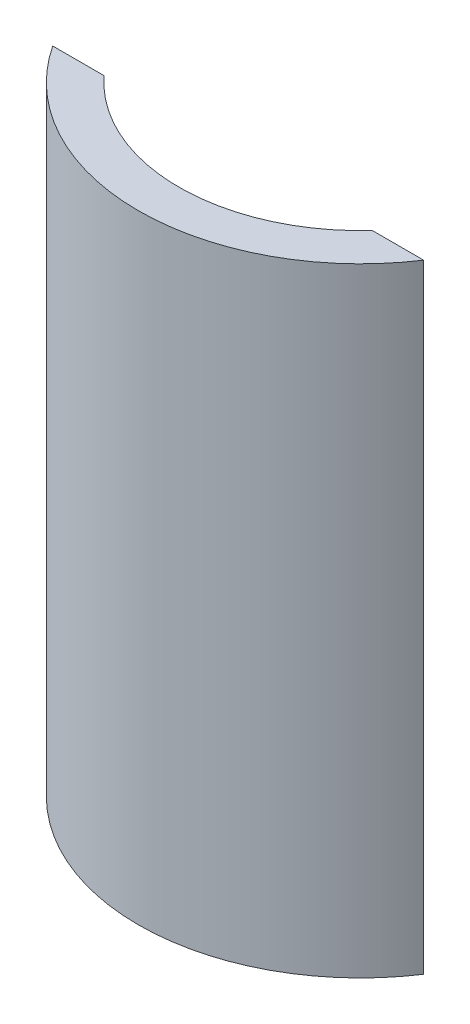
ISO-10303-21;
HEADER;
FILE_DESCRIPTION(('STEP AP214'),'2;1');
FILE_NAME('part.step','',(''),(''),'','','');
FILE_SCHEMA(('AUTOMOTIVE_DESIGN { 1 0 10303 214 1 1 1 1 }'));
ENDSEC;
DATA;
#1=APPLICATION_CONTEXT('core data for automotive mechanical design processes');
#2=APPLICATION_PROTOCOL_DEFINITION('international standard','automotive_design',2000,#1);
#3=PRODUCT_CONTEXT('',#1,'mechanical');
#4=PRODUCT('Part','Part','',(#3));
#5=PRODUCT_RELATED_PRODUCT_CATEGORY('part','',(#4));
#6=PRODUCT_DEFINITION_FORMATION('','',#4);
#7=PRODUCT_DEFINITION_CONTEXT('part definition',#1,'design');
#8=PRODUCT_DEFINITION('design','',#6,#7);
#9=PRODUCT_DEFINITION_SHAPE('','',#8);
#10=(LENGTH_UNIT() NAMED_UNIT(*) SI_UNIT(.MILLI.,.METRE.));
#11=(NAMED_UNIT(*) PLANE_ANGLE_UNIT() SI_UNIT($,.RADIAN.));
#12=(NAMED_UNIT(*) SI_UNIT($,.STERADIAN.) SOLID_ANGLE_UNIT());
#13=UNCERTAINTY_MEASURE_WITH_UNIT(LENGTH_MEASURE(1.E-05),#10,'distance_accuracy_value','');
#14=(GEOMETRIC_REPRESENTATION_CONTEXT(3) GLOBAL_UNCERTAINTY_ASSIGNED_CONTEXT((#13)) GLOBAL_UNIT_ASSIGNED_CONTEXT((#10,
#11,#12)) REPRESENTATION_CONTEXT('',''));
#15=CARTESIAN_POINT('',(0.,0.,0.));
#16=DIRECTION('',(0.,0.,1.));
#17=DIRECTION('',(1.,0.,0.));
#18=AXIS2_PLACEMENT_3D('',#15,#16,#17);
#19=CARTESIAN_POINT('',(0.,0.,27.6960130524233));
#20=DIRECTION('',(0.,0.,1.));
#21=DIRECTION('',(1.,0.,0.));
#22=AXIS2_PLACEMENT_3D('',#19,#20,#21);
#23=PLANE('',#22);
#24=DIRECTION('',(-1.,0.,0.));
#25=VECTOR('',#24,1.);
#26=CARTESIAN_POINT('',(-42.3504748256234,9.025,27.6960130524233));
#27=LINE('',#26,#25);
#28=CARTESIAN_POINT('',(-30.3487580211707,9.025,27.6960130524233));
#29=VERTEX_POINT('',#28);
#30=CARTESIAN_POINT('',(-41.9787580211706,9.02500000000001,27.6960130524233));
#31=VERTEX_POINT('',#30);
#32=EDGE_CURVE('E309',#29,#31,#27,.T.);
#33=ORIENTED_EDGE('',*,*,#32,.F.);
#34=DIRECTION('',(0.,-1.,0.));
#35=VECTOR('',#34,1.);
#36=CARTESIAN_POINT('',(-30.3487580211706,100.,27.6960130524233));
#37=LINE('',#36,#35);
#38=CARTESIAN_POINT('',(-30.3487580211706,0.,27.6960130524233));
#39=VERTEX_POINT('',#38);
#40=EDGE_CURVE('E217',#29,#39,#37,.T.);
#41=ORIENTED_EDGE('',*,*,#40,.T.);
#42=DIRECTION('',(1.,0.,0.));
#43=VECTOR('',#42,1.);
#44=CARTESIAN_POINT('',(0.,0.,27.6960130524233));
#45=LINE('',#44,#43);
#46=CARTESIAN_POINT('',(-41.9787580211706,0.,27.6960130524233));
#47=VERTEX_POINT('',#46);
#48=EDGE_CURVE('E43',#47,#39,#45,.T.);
#49=ORIENTED_EDGE('',*,*,#48,.F.);
#50=DIRECTION('',(0.,-1.,0.));
#51=VECTOR('',#50,1.);
#52=CARTESIAN_POINT('',(-41.9787580211706,100.,27.6960130524233));
#53=LINE('',#52,#51);
#54=EDGE_CURVE('E257',#31,#47,#53,.T.);
#55=ORIENTED_EDGE('',*,*,#54,.F.);
#56=EDGE_LOOP('',(#33,#41,#49,#55));
#57=FACE_BOUND('',#56,.T.);
#58=ADVANCED_FACE('F40',(#57),#23,.F.);
#59=CARTESIAN_POINT('',(30.3487580211706,0.,27.6960130524233));
#60=VERTEX_POINT('',#59);
#61=CARTESIAN_POINT('',(41.9787580211706,0.,27.6960130524233));
#62=VERTEX_POINT('',#61);
#63=EDGE_CURVE('E273',#60,#62,#45,.T.);
#64=ORIENTED_EDGE('',*,*,#63,.F.);
#65=DIRECTION('',(0.,-1.,0.));
#66=VECTOR('',#65,1.);
#67=CARTESIAN_POINT('',(30.3487580211706,100.,27.6960130524233));
#68=LINE('',#67,#66);
#69=CARTESIAN_POINT('',(30.3487580211707,9.02500000000001,27.6960130524232));
#70=VERTEX_POINT('',#69);
#71=EDGE_CURVE('E290',#70,#60,#68,.T.);
#72=ORIENTED_EDGE('',*,*,#71,.F.);
#73=DIRECTION('',(-1.,0.,0.));
#74=VECTOR('',#73,1.);
#75=CARTESIAN_POINT('',(42.3504748256234,9.025,27.6960130524232));
#76=LINE('',#75,#74);
#77=CARTESIAN_POINT('',(41.9787580211707,9.02500000000001,27.6960130524232));
#78=VERTEX_POINT('',#77);
#79=EDGE_CURVE('E312',#78,#70,#76,.T.);
#80=ORIENTED_EDGE('',*,*,#79,.F.);
#81=DIRECTION('',(0.,-1.,0.));
#82=VECTOR('',#81,1.);
#83=CARTESIAN_POINT('',(41.9787580211706,100.,27.6960130524233));
#84=LINE('',#83,#82);
#85=EDGE_CURVE('E254',#62,#78,#84,.F.);
#86=ORIENTED_EDGE('',*,*,#85,.F.);
#87=EDGE_LOOP('',(#64,#72,#80,#86));
#88=FACE_BOUND('',#87,.T.);
#89=ADVANCED_FACE('F339',(#88),#23,.F.);
#90=DIRECTION('',(-1.,0.,0.));
#91=VECTOR('',#90,1.);
#92=CARTESIAN_POINT('',(-42.3504748256234,29.025,27.6960130524233));
#93=LINE('',#92,#91);
#94=CARTESIAN_POINT('',(-30.3487580211707,29.025,27.6960130524233));
#95=VERTEX_POINT('',#94);
#96=CARTESIAN_POINT('',(-41.9787580211706,29.025,27.6960130524233));
#97=VERTEX_POINT('',#96);
#98=EDGE_CURVE('E221',#95,#97,#93,.T.);
#99=ORIENTED_EDGE('',*,*,#98,.F.);
#100=CARTESIAN_POINT('',(-30.3487580211707,10.975,27.6960130524233));
#101=VERTEX_POINT('',#100);
#102=EDGE_CURVE('E207',#95,#101,#37,.T.);
#103=ORIENTED_EDGE('',*,*,#102,.T.);
#104=DIRECTION('',(-1.,0.,0.));
#105=VECTOR('',#104,1.);
#106=CARTESIAN_POINT('',(-42.3504748256234,10.975,27.6960130524233));
#107=LINE('',#106,#105);
#108=CARTESIAN_POINT('',(-41.9787580211706,10.975,27.6960130524233));
#109=VERTEX_POINT('',#108);
#110=EDGE_CURVE('E301',#101,#109,#107,.T.);
#111=ORIENTED_EDGE('',*,*,#110,.T.);
#112=EDGE_CURVE('E223',#97,#109,#53,.T.);
#113=ORIENTED_EDGE('',*,*,#112,.F.);
#114=EDGE_LOOP('',(#99,#103,#111,#113));
#115=FACE_BOUND('',#114,.T.);
#116=ADVANCED_FACE('F222',(#115),#23,.F.);
#117=CARTESIAN_POINT('',(-30.3487580211707,49.025,27.6960130524233));
#118=VERTEX_POINT('',#117);
#119=CARTESIAN_POINT('',(-30.3487580211707,30.975,27.6960130524233));
#120=VERTEX_POINT('',#119);
#121=EDGE_CURVE('E218',#118,#120,#37,.T.);
#122=ORIENTED_EDGE('',*,*,#121,.T.);
#123=DIRECTION('',(-1.,0.,0.));
#124=VECTOR('',#123,1.);
#125=CARTESIAN_POINT('',(-42.3504748256234,30.975,27.6960130524233));
#126=LINE('',#125,#124);
#127=CARTESIAN_POINT('',(-41.9787580211706,30.975,27.6960130524233));
#128=VERTEX_POINT('',#127);
#129=EDGE_CURVE('E56',#120,#128,#126,.T.);
#130=ORIENTED_EDGE('',*,*,#129,.T.);
#131=CARTESIAN_POINT('',(-41.9787580211706,49.025,27.6960130524233));
#132=VERTEX_POINT('',#131);
#133=EDGE_CURVE('E264',#132,#128,#53,.T.);
#134=ORIENTED_EDGE('',*,*,#133,.F.);
#135=DIRECTION('',(-1.,0.,0.));
#136=VECTOR('',#135,1.);
#137=CARTESIAN_POINT('',(-42.3504748256234,49.025,27.6960130524233));
#138=LINE('',#137,#136);
#139=EDGE_CURVE('E394',#118,#132,#138,.T.);
#140=ORIENTED_EDGE('',*,*,#139,.F.);
#141=EDGE_LOOP('',(#122,#130,#134,#140));
#142=FACE_BOUND('',#141,.T.);
#143=ADVANCED_FACE('F347',(#142),#23,.F.);
#144=DIRECTION('',(-1.,0.,0.));
#145=VECTOR('',#144,1.);
#146=CARTESIAN_POINT('',(-42.3504748256234,69.025,27.6960130524233));
#147=LINE('',#146,#145);
#148=CARTESIAN_POINT('',(-30.3487580211707,69.025,27.6960130524233));
#149=VERTEX_POINT('',#148);
#150=CARTESIAN_POINT('',(-41.9787580211706,69.025,27.6960130524233));
#151=VERTEX_POINT('',#150);
#152=EDGE_CURVE('E427',#149,#151,#147,.T.);
#153=ORIENTED_EDGE('',*,*,#152,.F.);
#154=CARTESIAN_POINT('',(-30.3487580211707,50.975,27.6960130524233));
#155=VERTEX_POINT('',#154);
#156=EDGE_CURVE('E244',#149,#155,#37,.T.);
#157=ORIENTED_EDGE('',*,*,#156,.T.);
#158=DIRECTION('',(-1.,0.,0.));
#159=VECTOR('',#158,1.);
#160=CARTESIAN_POINT('',(-42.3504748256234,50.975,27.6960130524233));
#161=LINE('',#160,#159);
#162=CARTESIAN_POINT('',(-41.9787580211706,50.975,27.6960130524233));
#163=VERTEX_POINT('',#162);
#164=EDGE_CURVE('E64',#155,#163,#161,.T.);
#165=ORIENTED_EDGE('',*,*,#164,.T.);
#166=EDGE_CURVE('E261',#151,#163,#53,.T.);
#167=ORIENTED_EDGE('',*,*,#166,.F.);
#168=EDGE_LOOP('',(#153,#157,#165,#167));
#169=FACE_BOUND('',#168,.T.);
#170=ADVANCED_FACE('F447',(#169),#23,.F.);
#171=DIRECTION('',(1.,0.,0.));
#172=VECTOR('',#171,1.);
#173=CARTESIAN_POINT('',(0.,140.,27.6960130524233));
#174=LINE('',#173,#172);
#175=CARTESIAN_POINT('',(-41.9787580211706,140.,27.6960130524233));
#176=VERTEX_POINT('',#175);
#177=CARTESIAN_POINT('',(-30.3487580211707,140.,27.6960130524233));
#178=VERTEX_POINT('',#177);
#179=EDGE_CURVE('E246',#176,#178,#174,.T.);
#180=ORIENTED_EDGE('',*,*,#179,.T.);
#181=CARTESIAN_POINT('',(-30.3487580211707,90.975,27.6960130524233));
#182=VERTEX_POINT('',#181);
#183=EDGE_CURVE('E231',#178,#182,#37,.T.);
#184=ORIENTED_EDGE('',*,*,#183,.T.);
#185=DIRECTION('',(-1.,0.,0.));
#186=VECTOR('',#185,1.);
#187=CARTESIAN_POINT('',(-42.3504748256234,90.975,27.6960130524233));
#188=LINE('',#187,#186);
#189=CARTESIAN_POINT('',(-41.9787580211706,90.975,27.6960130524233));
#190=VERTEX_POINT('',#189);
#191=EDGE_CURVE('E48',#182,#190,#188,.T.);
#192=ORIENTED_EDGE('',*,*,#191,.T.);
#193=EDGE_CURVE('E252',#176,#190,#53,.T.);
#194=ORIENTED_EDGE('',*,*,#193,.F.);
#195=EDGE_LOOP('',(#180,#184,#192,#194));
#196=FACE_BOUND('',#195,.T.);
#197=ADVANCED_FACE('F348',(#196),#23,.F.);
#198=DIRECTION('',(-1.,0.,0.));
#199=VECTOR('',#198,1.);
#200=CARTESIAN_POINT('',(-42.3504748256234,70.975,27.6960130524233));
#201=LINE('',#200,#199);
#202=CARTESIAN_POINT('',(-30.3487580211707,70.975,27.6960130524233));
#203=VERTEX_POINT('',#202);
#204=CARTESIAN_POINT('',(-41.9787580211706,70.975,27.6960130524233));
#205=VERTEX_POINT('',#204);
#206=EDGE_CURVE('E366',#203,#205,#201,.T.);
#207=ORIENTED_EDGE('',*,*,#206,.T.);
#208=CARTESIAN_POINT('',(-41.9787580211706,89.025,27.6960130524233));
#209=VERTEX_POINT('',#208);
#210=EDGE_CURVE('E256',#209,#205,#53,.T.);
#211=ORIENTED_EDGE('',*,*,#210,.F.);
#212=DIRECTION('',(-1.,0.,0.));
#213=VECTOR('',#212,1.);
#214=CARTESIAN_POINT('',(-42.3504748256234,89.025,27.6960130524233));
#215=LINE('',#214,#213);
#216=CARTESIAN_POINT('',(-30.3487580211707,89.025,27.6960130524233));
#217=VERTEX_POINT('',#216);
#218=EDGE_CURVE('E433',#217,#209,#215,.T.);
#219=ORIENTED_EDGE('',*,*,#218,.F.);
#220=EDGE_CURVE('E238',#217,#203,#37,.T.);
#221=ORIENTED_EDGE('',*,*,#220,.T.);
#222=EDGE_LOOP('',(#207,#211,#219,#221));
#223=FACE_BOUND('',#222,.T.);
#224=ADVANCED_FACE('F337',(#223),#23,.F.);
#225=DIRECTION('',(-1.,0.,0.));
#226=VECTOR('',#225,1.);
#227=CARTESIAN_POINT('',(42.3504748256234,10.975,27.6960130524232));
#228=LINE('',#227,#226);
#229=CARTESIAN_POINT('',(41.9787580211707,10.975,27.6960130524232));
#230=VERTEX_POINT('',#229);
#231=CARTESIAN_POINT('',(30.3487580211707,10.975,27.6960130524232));
#232=VERTEX_POINT('',#231);
#233=EDGE_CURVE('E304',#230,#232,#228,.T.);
#234=ORIENTED_EDGE('',*,*,#233,.T.);
#235=CARTESIAN_POINT('',(30.3487580211707,29.025,27.6960130524232));
#236=VERTEX_POINT('',#235);
#237=EDGE_CURVE('E289',#236,#232,#68,.T.);
#238=ORIENTED_EDGE('',*,*,#237,.F.);
#239=DIRECTION('',(-1.,0.,0.));
#240=VECTOR('',#239,1.);
#241=CARTESIAN_POINT('',(42.3504748256234,29.025,27.6960130524232));
#242=LINE('',#241,#240);
#243=CARTESIAN_POINT('',(41.9787580211707,29.025,27.6960130524232));
#244=VERTEX_POINT('',#243);
#245=EDGE_CURVE('E226',#244,#236,#242,.T.);
#246=ORIENTED_EDGE('',*,*,#245,.F.);
#247=EDGE_CURVE('E265',#230,#244,#84,.F.);
#248=ORIENTED_EDGE('',*,*,#247,.F.);
#249=EDGE_LOOP('',(#234,#238,#246,#248));
#250=FACE_BOUND('',#249,.T.);
#251=ADVANCED_FACE('F396',(#250),#23,.F.);
#252=DIRECTION('',(-1.,0.,0.));
#253=VECTOR('',#252,1.);
#254=CARTESIAN_POINT('',(42.3504748256234,30.975,27.6960130524232));
#255=LINE('',#254,#253);
#256=CARTESIAN_POINT('',(41.9787580211707,30.975,27.6960130524232));
#257=VERTEX_POINT('',#256);
#258=CARTESIAN_POINT('',(30.3487580211707,30.975,27.6960130524232));
#259=VERTEX_POINT('',#258);
#260=EDGE_CURVE('E389',#257,#259,#255,.T.);
#261=ORIENTED_EDGE('',*,*,#260,.T.);
#262=CARTESIAN_POINT('',(30.3487580211707,49.025,27.6960130524232));
#263=VERTEX_POINT('',#262);
#264=EDGE_CURVE('E378',#263,#259,#68,.T.);
#265=ORIENTED_EDGE('',*,*,#264,.F.);
#266=DIRECTION('',(-1.,0.,0.));
#267=VECTOR('',#266,1.);
#268=CARTESIAN_POINT('',(42.3504748256234,49.025,27.6960130524232));
#269=LINE('',#268,#267);
#270=CARTESIAN_POINT('',(41.9787580211707,49.025,27.6960130524232));
#271=VERTEX_POINT('',#270);
#272=EDGE_CURVE('E423',#271,#263,#269,.T.);
#273=ORIENTED_EDGE('',*,*,#272,.F.);
#274=EDGE_CURVE('E269',#257,#271,#84,.F.);
#275=ORIENTED_EDGE('',*,*,#274,.F.);
#276=EDGE_LOOP('',(#261,#265,#273,#275));
#277=FACE_BOUND('',#276,.T.);
#278=ADVANCED_FACE('F355',(#277),#23,.F.);
#279=DIRECTION('',(-1.,0.,0.));
#280=VECTOR('',#279,1.);
#281=CARTESIAN_POINT('',(42.3504748256234,50.975,27.6960130524232));
#282=LINE('',#281,#280);
#283=CARTESIAN_POINT('',(41.9787580211707,50.975,27.6960130524232));
#284=VERTEX_POINT('',#283);
#285=CARTESIAN_POINT('',(30.3487580211707,50.975,27.6960130524232));
#286=VERTEX_POINT('',#285);
#287=EDGE_CURVE('E421',#284,#286,#282,.T.);
#288=ORIENTED_EDGE('',*,*,#287,.T.);
#289=CARTESIAN_POINT('',(30.3487580211707,69.025,27.6960130524232));
#290=VERTEX_POINT('',#289);
#291=EDGE_CURVE('E374',#290,#286,#68,.T.);
#292=ORIENTED_EDGE('',*,*,#291,.F.);
#293=DIRECTION('',(-1.,0.,0.));
#294=VECTOR('',#293,1.);
#295=CARTESIAN_POINT('',(42.3504748256234,69.025,27.6960130524232));
#296=LINE('',#295,#294);
#297=CARTESIAN_POINT('',(41.9787580211707,69.025,27.6960130524232));
#298=VERTEX_POINT('',#297);
#299=EDGE_CURVE('E372',#298,#290,#296,.T.);
#300=ORIENTED_EDGE('',*,*,#299,.F.);
#301=EDGE_CURVE('E272',#284,#298,#84,.F.);
#302=ORIENTED_EDGE('',*,*,#301,.F.);
#303=EDGE_LOOP('',(#288,#292,#300,#302));
#304=FACE_BOUND('',#303,.T.);
#305=ADVANCED_FACE('F350',(#304),#23,.F.);
#306=DIRECTION('',(-1.,0.,0.));
#307=VECTOR('',#306,1.);
#308=CARTESIAN_POINT('',(42.3504748256234,70.975,27.6960130524232));
#309=LINE('',#308,#307);
#310=CARTESIAN_POINT('',(41.9787580211707,70.975,27.6960130524232));
#311=VERTEX_POINT('',#310);
#312=CARTESIAN_POINT('',(30.3487580211707,70.975,27.6960130524232));
#313=VERTEX_POINT('',#312);
#314=EDGE_CURVE('E360',#311,#313,#309,.T.);
#315=ORIENTED_EDGE('',*,*,#314,.T.);
#316=CARTESIAN_POINT('',(30.3487580211707,89.025,27.6960130524232));
#317=VERTEX_POINT('',#316);
#318=EDGE_CURVE('E293',#317,#313,#68,.T.);
#319=ORIENTED_EDGE('',*,*,#318,.F.);
#320=DIRECTION('',(-1.,0.,0.));
#321=VECTOR('',#320,1.);
#322=CARTESIAN_POINT('',(42.3504748256234,89.025,27.6960130524232));
#323=LINE('',#322,#321);
#324=CARTESIAN_POINT('',(41.9787580211707,89.025,27.6960130524232));
#325=VERTEX_POINT('',#324);
#326=EDGE_CURVE('E434',#325,#317,#323,.T.);
#327=ORIENTED_EDGE('',*,*,#326,.F.);
#328=EDGE_CURVE('E270',#311,#325,#84,.F.);
#329=ORIENTED_EDGE('',*,*,#328,.F.);
#330=EDGE_LOOP('',(#315,#319,#327,#329));
#331=FACE_BOUND('',#330,.T.);
#332=ADVANCED_FACE('F336',(#331),#23,.F.);
#333=CARTESIAN_POINT('',(30.3487580211706,140.,27.6960130524233));
#334=VERTEX_POINT('',#333);
#335=CARTESIAN_POINT('',(41.9787580211706,140.,27.6960130524233));
#336=VERTEX_POINT('',#335);
#337=EDGE_CURVE('E239',#334,#336,#174,.T.);
#338=ORIENTED_EDGE('',*,*,#337,.T.);
#339=CARTESIAN_POINT('',(41.9787580211707,90.975,27.6960130524232));
#340=VERTEX_POINT('',#339);
#341=EDGE_CURVE('E266',#340,#336,#84,.F.);
#342=ORIENTED_EDGE('',*,*,#341,.F.);
#343=DIRECTION('',(-1.,0.,0.));
#344=VECTOR('',#343,1.);
#345=CARTESIAN_POINT('',(42.3504748256234,90.975,27.6960130524232));
#346=LINE('',#345,#344);
#347=CARTESIAN_POINT('',(30.3487580211707,90.975,27.6960130524232));
#348=VERTEX_POINT('',#347);
#349=EDGE_CURVE('E11',#340,#348,#346,.T.);
#350=ORIENTED_EDGE('',*,*,#349,.T.);
#351=EDGE_CURVE('E286',#334,#348,#68,.T.);
#352=ORIENTED_EDGE('',*,*,#351,.F.);
#353=EDGE_LOOP('',(#338,#342,#350,#352));
#354=FACE_BOUND('',#353,.T.);
#355=ADVANCED_FACE('F327',(#354),#23,.F.);
#356=CARTESIAN_POINT('',(42.3504748256234,89.025,27.6960130524232));
#357=DIRECTION('',(0.,0.,-1.));
#358=DIRECTION('',(-1.,0.,0.));
#359=AXIS2_PLACEMENT_3D('',#356,#357,#358);
#360=PLANE('',#359);
#361=DIRECTION('',(0.,-1.,0.));
#362=VECTOR('',#361,1.);
#363=CARTESIAN_POINT('',(41.9787580211707,100.,27.6960130524232));
#364=LINE('',#363,#362);
#365=EDGE_CURVE('E402',#340,#325,#364,.T.);
#366=ORIENTED_EDGE('',*,*,#365,.T.);
#367=ORIENTED_EDGE('',*,*,#326,.T.);
#368=EDGE_CURVE('E288',#348,#317,#68,.T.);
#369=ORIENTED_EDGE('',*,*,#368,.F.);
#370=ORIENTED_EDGE('',*,*,#349,.F.);
#371=EDGE_LOOP('',(#366,#367,#369,#370));
#372=FACE_BOUND('',#371,.T.);
#373=ADVANCED_FACE('F335',(#372),#360,.T.);
#374=CARTESIAN_POINT('',(0.,140.,0.));
#375=DIRECTION('',(0.,1.,0.));
#376=DIRECTION('',(0.,0.,1.));
#377=AXIS2_PLACEMENT_3D('',#374,#375,#376);
#378=PLANE('',#377);
#379=ORIENTED_EDGE('',*,*,#179,.F.);
#380=CARTESIAN_POINT('',(0.,140.,0.));
#381=DIRECTION('',(0.,1.,0.));
#382=DIRECTION('',(0.,0.,1.));
#383=AXIS2_PLACEMENT_3D('',#380,#381,#382);
#384=CIRCLE('',#383,50.292);
#385=EDGE_CURVE('E320',#176,#336,#384,.T.);
#386=ORIENTED_EDGE('',*,*,#385,.T.);
#387=ORIENTED_EDGE('',*,*,#337,.F.);
#388=CARTESIAN_POINT('',(0.,140.,0.));
#389=DIRECTION('',(0.,1.,0.));
#390=DIRECTION('',(0.,0.,1.));
#391=AXIS2_PLACEMENT_3D('',#388,#389,#390);
#392=CIRCLE('',#391,41.086691913898);
#393=EDGE_CURVE('E318',#178,#334,#392,.T.);
#394=ORIENTED_EDGE('',*,*,#393,.F.);
#395=EDGE_LOOP('',(#379,#386,#387,#394));
#396=FACE_BOUND('',#395,.T.);
#397=ADVANCED_FACE('F475',(#396),#378,.T.);
#398=CARTESIAN_POINT('',(0.,0.,0.));
#399=DIRECTION('',(0.,1.,0.));
#400=DIRECTION('',(0.,0.,1.));
#401=AXIS2_PLACEMENT_3D('',#398,#399,#400);
#402=PLANE('',#401);
#403=CARTESIAN_POINT('',(0.,0.,0.));
#404=DIRECTION('',(0.,1.,0.));
#405=DIRECTION('',(0.,0.,1.));
#406=AXIS2_PLACEMENT_3D('',#403,#404,#405);
#407=CIRCLE('',#406,50.292);
#408=EDGE_CURVE('E230',#47,#62,#407,.T.);
#409=ORIENTED_EDGE('',*,*,#408,.F.);
#410=ORIENTED_EDGE('',*,*,#48,.T.);
#411=CARTESIAN_POINT('',(0.,0.,0.));
#412=DIRECTION('',(0.,1.,0.));
#413=DIRECTION('',(0.,0.,1.));
#414=AXIS2_PLACEMENT_3D('',#411,#412,#413);
#415=CIRCLE('',#414,41.086691913898);
#416=EDGE_CURVE('E234',#39,#60,#415,.T.);
#417=ORIENTED_EDGE('',*,*,#416,.T.);
#418=ORIENTED_EDGE('',*,*,#63,.T.);
#419=EDGE_LOOP('',(#409,#410,#417,#418));
#420=FACE_BOUND('',#419,.T.);
#421=ADVANCED_FACE('F322',(#420),#402,.F.);
#422=CARTESIAN_POINT('',(0.,100.,0.));
#423=DIRECTION('',(0.,-1.,0.));
#424=DIRECTION('',(0.,0.,-1.));
#425=AXIS2_PLACEMENT_3D('',#422,#423,#424);
#426=CYLINDRICAL_SURFACE('',#425,41.086691913898);
#427=ORIENTED_EDGE('',*,*,#416,.F.);
#428=ORIENTED_EDGE('',*,*,#40,.F.);
#429=DIRECTION('',(0.,-1.,0.));
#430=VECTOR('',#429,1.);
#431=CARTESIAN_POINT('',(-30.3487580211706,100.,27.6960130524233));
#432=LINE('',#431,#430);
#433=EDGE_CURVE('E214',#101,#29,#432,.T.);
#434=ORIENTED_EDGE('',*,*,#433,.F.);
#435=ORIENTED_EDGE('',*,*,#102,.F.);
#436=EDGE_CURVE('E212',#120,#95,#37,.T.);
#437=ORIENTED_EDGE('',*,*,#436,.F.);
#438=ORIENTED_EDGE('',*,*,#121,.F.);
#439=EDGE_CURVE('E229',#155,#118,#37,.T.);
#440=ORIENTED_EDGE('',*,*,#439,.F.);
#441=ORIENTED_EDGE('',*,*,#156,.F.);
#442=EDGE_CURVE('E232',#203,#149,#37,.T.);
#443=ORIENTED_EDGE('',*,*,#442,.F.);
#444=ORIENTED_EDGE('',*,*,#220,.F.);
#445=EDGE_CURVE('E295',#182,#217,#37,.T.);
#446=ORIENTED_EDGE('',*,*,#445,.F.);
#447=ORIENTED_EDGE('',*,*,#183,.F.);
#448=ORIENTED_EDGE('',*,*,#393,.T.);
#449=ORIENTED_EDGE('',*,*,#351,.T.);
#450=ORIENTED_EDGE('',*,*,#368,.T.);
#451=ORIENTED_EDGE('',*,*,#318,.T.);
#452=EDGE_CURVE('E369',#313,#290,#68,.T.);
#453=ORIENTED_EDGE('',*,*,#452,.T.);
#454=ORIENTED_EDGE('',*,*,#291,.T.);
#455=EDGE_CURVE('E375',#286,#263,#68,.T.);
#456=ORIENTED_EDGE('',*,*,#455,.T.);
#457=ORIENTED_EDGE('',*,*,#264,.T.);
#458=EDGE_CURVE('E294',#259,#236,#68,.T.);
#459=ORIENTED_EDGE('',*,*,#458,.T.);
#460=ORIENTED_EDGE('',*,*,#237,.T.);
#461=DIRECTION('',(0.,-1.,0.));
#462=VECTOR('',#461,1.);
#463=CARTESIAN_POINT('',(30.3487580211707,100.,27.6960130524232));
#464=LINE('',#463,#462);
#465=EDGE_CURVE('E315',#232,#70,#464,.T.);
#466=ORIENTED_EDGE('',*,*,#465,.T.);
#467=ORIENTED_EDGE('',*,*,#71,.T.);
#468=EDGE_LOOP('',(#427,#428,#434,#435,#437,#438,#440,#441,#443,#444,#446,#447,#448,#449,#450,
#451,#453,#454,#456,#457,#459,#460,#466,#467));
#469=FACE_BOUND('',#468,.T.);
#470=ADVANCED_FACE('F210',(#469),#426,.F.);
#471=CARTESIAN_POINT('',(0.,100.,0.));
#472=DIRECTION('',(0.,-1.,0.));
#473=DIRECTION('',(0.,0.,-1.));
#474=AXIS2_PLACEMENT_3D('',#471,#472,#473);
#475=CYLINDRICAL_SURFACE('',#474,50.292);
#476=ORIENTED_EDGE('',*,*,#385,.F.);
#477=ORIENTED_EDGE('',*,*,#193,.T.);
#478=DIRECTION('',(0.,-1.,0.));
#479=VECTOR('',#478,1.);
#480=CARTESIAN_POINT('',(-41.9787580211706,100.,27.6960130524233));
#481=LINE('',#480,#479);
#482=EDGE_CURVE('E415',#209,#190,#481,.F.);
#483=ORIENTED_EDGE('',*,*,#482,.F.);
#484=ORIENTED_EDGE('',*,*,#210,.T.);
#485=DIRECTION('',(0.,-1.,0.));
#486=VECTOR('',#485,1.);
#487=CARTESIAN_POINT('',(-41.9787580211706,100.,27.6960130524233));
#488=LINE('',#487,#486);
#489=EDGE_CURVE('E410',#151,#205,#488,.F.);
#490=ORIENTED_EDGE('',*,*,#489,.F.);
#491=ORIENTED_EDGE('',*,*,#166,.T.);
#492=DIRECTION('',(0.,-1.,0.));
#493=VECTOR('',#492,1.);
#494=CARTESIAN_POINT('',(-41.9787580211706,100.,27.6960130524233));
#495=LINE('',#494,#493);
#496=EDGE_CURVE('E413',#132,#163,#495,.F.);
#497=ORIENTED_EDGE('',*,*,#496,.F.);
#498=ORIENTED_EDGE('',*,*,#133,.T.);
#499=DIRECTION('',(0.,-1.,0.));
#500=VECTOR('',#499,1.);
#501=CARTESIAN_POINT('',(-41.9787580211706,100.,27.6960130524233));
#502=LINE('',#501,#500);
#503=EDGE_CURVE('E225',#97,#128,#502,.F.);
#504=ORIENTED_EDGE('',*,*,#503,.F.);
#505=ORIENTED_EDGE('',*,*,#112,.T.);
#506=DIRECTION('',(0.,-1.,0.));
#507=VECTOR('',#506,1.);
#508=CARTESIAN_POINT('',(-41.9787580211706,100.,27.6960130524233));
#509=LINE('',#508,#507);
#510=EDGE_CURVE('E279',#31,#109,#509,.F.);
#511=ORIENTED_EDGE('',*,*,#510,.F.);
#512=ORIENTED_EDGE('',*,*,#54,.T.);
#513=ORIENTED_EDGE('',*,*,#408,.T.);
#514=ORIENTED_EDGE('',*,*,#85,.T.);
#515=DIRECTION('',(0.,-1.,0.));
#516=VECTOR('',#515,1.);
#517=CARTESIAN_POINT('',(41.9787580211707,100.,27.6960130524232));
#518=LINE('',#517,#516);
#519=EDGE_CURVE('E282',#230,#78,#518,.T.);
#520=ORIENTED_EDGE('',*,*,#519,.F.);
#521=ORIENTED_EDGE('',*,*,#247,.T.);
#522=DIRECTION('',(0.,-1.,0.));
#523=VECTOR('',#522,1.);
#524=CARTESIAN_POINT('',(41.9787580211707,100.,27.6960130524232));
#525=LINE('',#524,#523);
#526=EDGE_CURVE('E392',#257,#244,#525,.T.);
#527=ORIENTED_EDGE('',*,*,#526,.F.);
#528=ORIENTED_EDGE('',*,*,#274,.T.);
#529=DIRECTION('',(0.,-1.,0.));
#530=VECTOR('',#529,1.);
#531=CARTESIAN_POINT('',(41.9787580211707,100.,27.6960130524232));
#532=LINE('',#531,#530);
#533=EDGE_CURVE('E314',#284,#271,#532,.T.);
#534=ORIENTED_EDGE('',*,*,#533,.F.);
#535=ORIENTED_EDGE('',*,*,#301,.T.);
#536=DIRECTION('',(0.,-1.,0.));
#537=VECTOR('',#536,1.);
#538=CARTESIAN_POINT('',(41.9787580211707,100.,27.6960130524232));
#539=LINE('',#538,#537);
#540=EDGE_CURVE('E406',#311,#298,#539,.T.);
#541=ORIENTED_EDGE('',*,*,#540,.F.);
#542=ORIENTED_EDGE('',*,*,#328,.T.);
#543=ORIENTED_EDGE('',*,*,#365,.F.);
#544=ORIENTED_EDGE('',*,*,#341,.T.);
#545=EDGE_LOOP('',(#476,#477,#483,#484,#490,#491,#497,#498,#504,#505,#511,#512,#513,#514,#520,
#521,#527,#528,#534,#535,#541,#542,#543,#544));
#546=FACE_BOUND('',#545,.T.);
#547=ADVANCED_FACE('F399',(#546),#475,.T.);
#548=CARTESIAN_POINT('',(42.3504748256234,69.025,27.6960130524232));
#549=DIRECTION('',(0.,0.,-1.));
#550=DIRECTION('',(-1.,0.,0.));
#551=AXIS2_PLACEMENT_3D('',#548,#549,#550);
#552=PLANE('',#551);
#553=ORIENTED_EDGE('',*,*,#540,.T.);
#554=ORIENTED_EDGE('',*,*,#299,.T.);
#555=ORIENTED_EDGE('',*,*,#452,.F.);
#556=ORIENTED_EDGE('',*,*,#314,.F.);
#557=EDGE_LOOP('',(#553,#554,#555,#556));
#558=FACE_BOUND('',#557,.T.);
#559=ADVANCED_FACE('F370',(#558),#552,.T.);
#560=CARTESIAN_POINT('',(42.3504748256234,49.025,27.6960130524232));
#561=DIRECTION('',(0.,0.,-1.));
#562=DIRECTION('',(-1.,0.,0.));
#563=AXIS2_PLACEMENT_3D('',#560,#561,#562);
#564=PLANE('',#563);
#565=ORIENTED_EDGE('',*,*,#533,.T.);
#566=ORIENTED_EDGE('',*,*,#272,.T.);
#567=ORIENTED_EDGE('',*,*,#455,.F.);
#568=ORIENTED_EDGE('',*,*,#287,.F.);
#569=EDGE_LOOP('',(#565,#566,#567,#568));
#570=FACE_BOUND('',#569,.T.);
#571=ADVANCED_FACE('F441',(#570),#564,.T.);
#572=CARTESIAN_POINT('',(42.3504748256234,29.025,27.6960130524232));
#573=DIRECTION('',(0.,0.,-1.));
#574=DIRECTION('',(-1.,0.,0.));
#575=AXIS2_PLACEMENT_3D('',#572,#573,#574);
#576=PLANE('',#575);
#577=ORIENTED_EDGE('',*,*,#526,.T.);
#578=ORIENTED_EDGE('',*,*,#245,.T.);
#579=ORIENTED_EDGE('',*,*,#458,.F.);
#580=ORIENTED_EDGE('',*,*,#260,.F.);
#581=EDGE_LOOP('',(#577,#578,#579,#580));
#582=FACE_BOUND('',#581,.T.);
#583=ADVANCED_FACE('F388',(#582),#576,.T.);
#584=CARTESIAN_POINT('',(-42.3504748256234,89.025,27.6960130524233));
#585=DIRECTION('',(0.,0.,-1.));
#586=DIRECTION('',(-1.,0.,0.));
#587=AXIS2_PLACEMENT_3D('',#584,#585,#586);
#588=PLANE('',#587);
#589=ORIENTED_EDGE('',*,*,#482,.T.);
#590=ORIENTED_EDGE('',*,*,#191,.F.);
#591=ORIENTED_EDGE('',*,*,#445,.T.);
#592=ORIENTED_EDGE('',*,*,#218,.T.);
#593=EDGE_LOOP('',(#589,#590,#591,#592));
#594=FACE_BOUND('',#593,.T.);
#595=ADVANCED_FACE('F471',(#594),#588,.T.);
#596=CARTESIAN_POINT('',(-42.3504748256234,69.025,27.6960130524233));
#597=DIRECTION('',(0.,0.,-1.));
#598=DIRECTION('',(-1.,0.,0.));
#599=AXIS2_PLACEMENT_3D('',#596,#597,#598);
#600=PLANE('',#599);
#601=ORIENTED_EDGE('',*,*,#489,.T.);
#602=ORIENTED_EDGE('',*,*,#206,.F.);
#603=ORIENTED_EDGE('',*,*,#442,.T.);
#604=ORIENTED_EDGE('',*,*,#152,.T.);
#605=EDGE_LOOP('',(#601,#602,#603,#604));
#606=FACE_BOUND('',#605,.T.);
#607=ADVANCED_FACE('F465',(#606),#600,.T.);
#608=CARTESIAN_POINT('',(-42.3504748256234,49.025,27.6960130524233));
#609=DIRECTION('',(0.,0.,-1.));
#610=DIRECTION('',(-1.,0.,0.));
#611=AXIS2_PLACEMENT_3D('',#608,#609,#610);
#612=PLANE('',#611);
#613=ORIENTED_EDGE('',*,*,#496,.T.);
#614=ORIENTED_EDGE('',*,*,#164,.F.);
#615=ORIENTED_EDGE('',*,*,#439,.T.);
#616=ORIENTED_EDGE('',*,*,#139,.T.);
#617=EDGE_LOOP('',(#613,#614,#615,#616));
#618=FACE_BOUND('',#617,.T.);
#619=ADVANCED_FACE('F468',(#618),#612,.T.);
#620=CARTESIAN_POINT('',(-42.3504748256234,29.025,27.6960130524233));
#621=DIRECTION('',(0.,0.,-1.));
#622=DIRECTION('',(-1.,0.,0.));
#623=AXIS2_PLACEMENT_3D('',#620,#621,#622);
#624=PLANE('',#623);
#625=ORIENTED_EDGE('',*,*,#503,.T.);
#626=ORIENTED_EDGE('',*,*,#129,.F.);
#627=ORIENTED_EDGE('',*,*,#436,.T.);
#628=ORIENTED_EDGE('',*,*,#98,.T.);
#629=EDGE_LOOP('',(#625,#626,#627,#628));
#630=FACE_BOUND('',#629,.T.);
#631=ADVANCED_FACE('F228',(#630),#624,.T.);
#632=CARTESIAN_POINT('',(42.3504748256234,9.025,27.6960130524232));
#633=DIRECTION('',(0.,0.,-1.));
#634=DIRECTION('',(-1.,0.,0.));
#635=AXIS2_PLACEMENT_3D('',#632,#633,#634);
#636=PLANE('',#635);
#637=ORIENTED_EDGE('',*,*,#233,.F.);
#638=ORIENTED_EDGE('',*,*,#519,.T.);
#639=ORIENTED_EDGE('',*,*,#79,.T.);
#640=ORIENTED_EDGE('',*,*,#465,.F.);
#641=EDGE_LOOP('',(#637,#638,#639,#640));
#642=FACE_BOUND('',#641,.T.);
#643=ADVANCED_FACE('F325',(#642),#636,.T.);
#644=CARTESIAN_POINT('',(-42.3504748256234,9.025,27.6960130524233));
#645=DIRECTION('',(0.,0.,-1.));
#646=DIRECTION('',(-1.,0.,0.));
#647=AXIS2_PLACEMENT_3D('',#644,#645,#646);
#648=PLANE('',#647);
#649=ORIENTED_EDGE('',*,*,#433,.T.);
#650=ORIENTED_EDGE('',*,*,#32,.T.);
#651=ORIENTED_EDGE('',*,*,#510,.T.);
#652=ORIENTED_EDGE('',*,*,#110,.F.);
#653=EDGE_LOOP('',(#649,#650,#651,#652));
#654=FACE_BOUND('',#653,.T.);
#655=ADVANCED_FACE('F323',(#654),#648,.T.);
#656=CLOSED_SHELL('',(#58,#89,#116,#143,#170,#197,#224,#251,#278,#305,#332,#355,#373,#397,#421,
#470,#547,#559,#571,#583,#595,#607,#619,#631,#643,#655));
#657=MANIFOLD_SOLID_BREP('B2',#656);
#658=ADVANCED_BREP_SHAPE_REPRESENTATION('',(#18,#657),#14);
#659=SHAPE_DEFINITION_REPRESENTATION(#9,#658);
ENDSEC;
END-ISO-10303-21;
